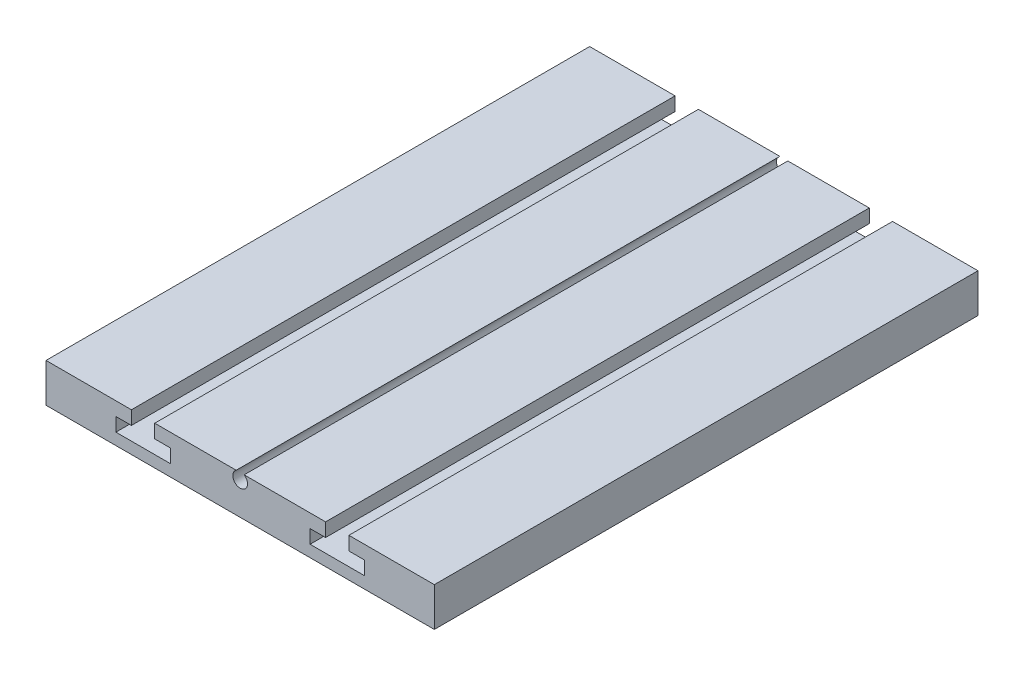
ISO-10303-21;
HEADER;
FILE_DESCRIPTION(('STEP AP214'),'2;1');
FILE_NAME('part.step','',(''),(''),'','','');
FILE_SCHEMA(('AUTOMOTIVE_DESIGN { 1 0 10303 214 1 1 1 1 }'));
ENDSEC;
DATA;
#1=APPLICATION_CONTEXT('core data for automotive mechanical design processes');
#2=APPLICATION_PROTOCOL_DEFINITION('international standard','automotive_design',2000,#1);
#3=PRODUCT_CONTEXT('',#1,'mechanical');
#4=PRODUCT('Part','Part','',(#3));
#5=PRODUCT_RELATED_PRODUCT_CATEGORY('part','',(#4));
#6=PRODUCT_DEFINITION_FORMATION('','',#4);
#7=PRODUCT_DEFINITION_CONTEXT('part definition',#1,'design');
#8=PRODUCT_DEFINITION('design','',#6,#7);
#9=PRODUCT_DEFINITION_SHAPE('','',#8);
#10=(LENGTH_UNIT() NAMED_UNIT(*) SI_UNIT(.MILLI.,.METRE.));
#11=(NAMED_UNIT(*) PLANE_ANGLE_UNIT() SI_UNIT($,.RADIAN.));
#12=(NAMED_UNIT(*) SI_UNIT($,.STERADIAN.) SOLID_ANGLE_UNIT());
#13=UNCERTAINTY_MEASURE_WITH_UNIT(LENGTH_MEASURE(1.E-05),#10,'distance_accuracy_value','');
#14=(GEOMETRIC_REPRESENTATION_CONTEXT(3) GLOBAL_UNCERTAINTY_ASSIGNED_CONTEXT((#13)) GLOBAL_UNIT_ASSIGNED_CONTEXT((#10,
#11,#12)) REPRESENTATION_CONTEXT('',''));
#15=CARTESIAN_POINT('',(0.,0.,0.));
#16=DIRECTION('',(0.,0.,1.));
#17=DIRECTION('',(1.,0.,0.));
#18=AXIS2_PLACEMENT_3D('',#15,#16,#17);
#19=CARTESIAN_POINT('',(0.,5.,70.));
#20=DIRECTION('',(0.,-1.,0.));
#21=DIRECTION('',(0.,0.,-1.));
#22=AXIS2_PLACEMENT_3D('',#19,#20,#21);
#23=PLANE('',#22);
#24=DIRECTION('',(-1.,0.,0.));
#25=VECTOR('',#24,1.);
#26=CARTESIAN_POINT('',(0.,5.,70.));
#27=LINE('',#26,#25);
#28=CARTESIAN_POINT('',(36.,5.,70.));
#29=VERTEX_POINT('',#28);
#30=CARTESIAN_POINT('',(25.512347538298,5.,70.));
#31=VERTEX_POINT('',#30);
#32=EDGE_CURVE('E326',#29,#31,#27,.T.);
#33=ORIENTED_EDGE('',*,*,#32,.F.);
#34=DIRECTION('',(0.,0.,1.));
#35=VECTOR('',#34,1.);
#36=CARTESIAN_POINT('',(36.,5.,0.));
#37=LINE('',#36,#35);
#38=CARTESIAN_POINT('',(36.,5.,0.));
#39=VERTEX_POINT('',#38);
#40=EDGE_CURVE('E301',#39,#29,#37,.T.);
#41=ORIENTED_EDGE('',*,*,#40,.F.);
#42=DIRECTION('',(-1.,0.,0.));
#43=VECTOR('',#42,1.);
#44=CARTESIAN_POINT('',(0.,5.,0.));
#45=LINE('',#44,#43);
#46=CARTESIAN_POINT('',(25.512347538298,5.,0.));
#47=VERTEX_POINT('',#46);
#48=EDGE_CURVE('E336',#39,#47,#45,.T.);
#49=ORIENTED_EDGE('',*,*,#48,.T.);
#50=DIRECTION('',(0.,0.,1.));
#51=VECTOR('',#50,1.);
#52=CARTESIAN_POINT('',(25.512347538298,5.,0.));
#53=LINE('',#52,#51);
#54=EDGE_CURVE('E57',#47,#31,#53,.T.);
#55=ORIENTED_EDGE('',*,*,#54,.T.);
#56=EDGE_LOOP('',(#33,#41,#49,#55));
#57=FACE_BOUND('',#56,.T.);
#58=ADVANCED_FACE('F35',(#57),#23,.F.);
#59=CARTESIAN_POINT('',(11.,5.,70.));
#60=VERTEX_POINT('',#59);
#61=CARTESIAN_POINT('',(0.,5.,70.));
#62=VERTEX_POINT('',#61);
#63=EDGE_CURVE('E321',#60,#62,#27,.T.);
#64=ORIENTED_EDGE('',*,*,#63,.F.);
#65=DIRECTION('',(0.,0.,1.));
#66=VECTOR('',#65,1.);
#67=CARTESIAN_POINT('',(11.,5.,0.));
#68=LINE('',#67,#66);
#69=CARTESIAN_POINT('',(11.,5.,0.));
#70=VERTEX_POINT('',#69);
#71=EDGE_CURVE('E241',#70,#60,#68,.T.);
#72=ORIENTED_EDGE('',*,*,#71,.F.);
#73=CARTESIAN_POINT('',(0.,5.,0.));
#74=VERTEX_POINT('',#73);
#75=EDGE_CURVE('E333',#70,#74,#45,.T.);
#76=ORIENTED_EDGE('',*,*,#75,.T.);
#77=DIRECTION('',(0.,0.,-1.));
#78=VECTOR('',#77,1.);
#79=CARTESIAN_POINT('',(0.,5.,70.));
#80=LINE('',#79,#78);
#81=EDGE_CURVE('E325',#62,#74,#80,.T.);
#82=ORIENTED_EDGE('',*,*,#81,.F.);
#83=EDGE_LOOP('',(#64,#72,#76,#82));
#84=FACE_BOUND('',#83,.T.);
#85=ADVANCED_FACE('F374',(#84),#23,.F.);
#86=CARTESIAN_POINT('',(50.,5.,0.));
#87=VERTEX_POINT('',#86);
#88=CARTESIAN_POINT('',(39.,5.,0.));
#89=VERTEX_POINT('',#88);
#90=EDGE_CURVE('E317',#87,#89,#45,.T.);
#91=ORIENTED_EDGE('',*,*,#90,.T.);
#92=DIRECTION('',(0.,0.,1.));
#93=VECTOR('',#92,1.);
#94=CARTESIAN_POINT('',(39.,5.,0.));
#95=LINE('',#94,#93);
#96=CARTESIAN_POINT('',(39.,5.,70.));
#97=VERTEX_POINT('',#96);
#98=EDGE_CURVE('E303',#89,#97,#95,.T.);
#99=ORIENTED_EDGE('',*,*,#98,.T.);
#100=CARTESIAN_POINT('',(50.,5.,70.));
#101=VERTEX_POINT('',#100);
#102=EDGE_CURVE('E322',#101,#97,#27,.T.);
#103=ORIENTED_EDGE('',*,*,#102,.F.);
#104=DIRECTION('',(0.,0.,-1.));
#105=VECTOR('',#104,1.);
#106=CARTESIAN_POINT('',(50.,5.,70.));
#107=LINE('',#106,#105);
#108=EDGE_CURVE('E339',#101,#87,#107,.T.);
#109=ORIENTED_EDGE('',*,*,#108,.T.);
#110=EDGE_LOOP('',(#91,#99,#103,#109));
#111=FACE_BOUND('',#110,.T.);
#112=ADVANCED_FACE('F362',(#111),#23,.F.);
#113=CARTESIAN_POINT('',(0.,0.,70.));
#114=DIRECTION('',(1.,0.,0.));
#115=DIRECTION('',(0.,0.,-1.));
#116=AXIS2_PLACEMENT_3D('',#113,#114,#115);
#117=PLANE('',#116);
#118=DIRECTION('',(0.,-1.,0.));
#119=VECTOR('',#118,1.);
#120=CARTESIAN_POINT('',(0.,0.,0.));
#121=LINE('',#120,#119);
#122=CARTESIAN_POINT('',(0.,0.,0.));
#123=VERTEX_POINT('',#122);
#124=EDGE_CURVE('E312',#74,#123,#121,.T.);
#125=ORIENTED_EDGE('',*,*,#124,.T.);
#126=DIRECTION('',(0.,0.,-1.));
#127=VECTOR('',#126,1.);
#128=CARTESIAN_POINT('',(0.,0.,70.));
#129=LINE('',#128,#127);
#130=CARTESIAN_POINT('',(0.,0.,70.));
#131=VERTEX_POINT('',#130);
#132=EDGE_CURVE('E43',#131,#123,#129,.T.);
#133=ORIENTED_EDGE('',*,*,#132,.F.);
#134=DIRECTION('',(0.,-1.,0.));
#135=VECTOR('',#134,1.);
#136=CARTESIAN_POINT('',(0.,0.,70.));
#137=LINE('',#136,#135);
#138=EDGE_CURVE('E313',#62,#131,#137,.T.);
#139=ORIENTED_EDGE('',*,*,#138,.F.);
#140=ORIENTED_EDGE('',*,*,#81,.T.);
#141=EDGE_LOOP('',(#125,#133,#139,#140));
#142=FACE_BOUND('',#141,.T.);
#143=ADVANCED_FACE('F37',(#142),#117,.F.);
#144=CARTESIAN_POINT('',(0.,0.,70.));
#145=DIRECTION('',(0.,1.,0.));
#146=DIRECTION('',(0.,0.,1.));
#147=AXIS2_PLACEMENT_3D('',#144,#145,#146);
#148=PLANE('',#147);
#149=DIRECTION('',(1.,0.,0.));
#150=VECTOR('',#149,1.);
#151=CARTESIAN_POINT('',(0.,0.,0.));
#152=LINE('',#151,#150);
#153=CARTESIAN_POINT('',(50.,0.,0.));
#154=VERTEX_POINT('',#153);
#155=EDGE_CURVE('E329',#123,#154,#152,.T.);
#156=ORIENTED_EDGE('',*,*,#155,.T.);
#157=DIRECTION('',(0.,0.,-1.));
#158=VECTOR('',#157,1.);
#159=CARTESIAN_POINT('',(50.,0.,70.));
#160=LINE('',#159,#158);
#161=CARTESIAN_POINT('',(50.,0.,70.));
#162=VERTEX_POINT('',#161);
#163=EDGE_CURVE('E342',#162,#154,#160,.T.);
#164=ORIENTED_EDGE('',*,*,#163,.F.);
#165=DIRECTION('',(1.,0.,0.));
#166=VECTOR('',#165,1.);
#167=CARTESIAN_POINT('',(0.,0.,70.));
#168=LINE('',#167,#166);
#169=EDGE_CURVE('E316',#131,#162,#168,.T.);
#170=ORIENTED_EDGE('',*,*,#169,.F.);
#171=ORIENTED_EDGE('',*,*,#132,.T.);
#172=EDGE_LOOP('',(#156,#164,#170,#171));
#173=FACE_BOUND('',#172,.T.);
#174=ADVANCED_FACE('F347',(#173),#148,.F.);
#175=CARTESIAN_POINT('',(50.,0.,70.));
#176=DIRECTION('',(-1.,0.,0.));
#177=DIRECTION('',(0.,0.,1.));
#178=AXIS2_PLACEMENT_3D('',#175,#176,#177);
#179=PLANE('',#178);
#180=DIRECTION('',(0.,1.,0.));
#181=VECTOR('',#180,1.);
#182=CARTESIAN_POINT('',(50.,0.,0.));
#183=LINE('',#182,#181);
#184=EDGE_CURVE('E331',#154,#87,#183,.T.);
#185=ORIENTED_EDGE('',*,*,#184,.T.);
#186=ORIENTED_EDGE('',*,*,#108,.F.);
#187=DIRECTION('',(0.,1.,0.));
#188=VECTOR('',#187,1.);
#189=CARTESIAN_POINT('',(50.,0.,70.));
#190=LINE('',#189,#188);
#191=EDGE_CURVE('E319',#162,#101,#190,.T.);
#192=ORIENTED_EDGE('',*,*,#191,.F.);
#193=ORIENTED_EDGE('',*,*,#163,.T.);
#194=EDGE_LOOP('',(#185,#186,#192,#193));
#195=FACE_BOUND('',#194,.T.);
#196=ADVANCED_FACE('F358',(#195),#179,.F.);
#197=CARTESIAN_POINT('',(24.487652461702,5.,0.));
#198=VERTEX_POINT('',#197);
#199=CARTESIAN_POINT('',(14.,5.,0.));
#200=VERTEX_POINT('',#199);
#201=EDGE_CURVE('E375',#198,#200,#45,.T.);
#202=ORIENTED_EDGE('',*,*,#201,.T.);
#203=DIRECTION('',(0.,0.,1.));
#204=VECTOR('',#203,1.);
#205=CARTESIAN_POINT('',(14.,5.,0.));
#206=LINE('',#205,#204);
#207=CARTESIAN_POINT('',(14.,5.,70.));
#208=VERTEX_POINT('',#207);
#209=EDGE_CURVE('E243',#200,#208,#206,.T.);
#210=ORIENTED_EDGE('',*,*,#209,.T.);
#211=CARTESIAN_POINT('',(24.487652461702,5.,70.));
#212=VERTEX_POINT('',#211);
#213=EDGE_CURVE('E373',#212,#208,#27,.T.);
#214=ORIENTED_EDGE('',*,*,#213,.F.);
#215=DIRECTION('',(0.,0.,1.));
#216=VECTOR('',#215,1.);
#217=CARTESIAN_POINT('',(24.487652461702,5.,0.));
#218=LINE('',#217,#216);
#219=EDGE_CURVE('E308',#212,#198,#218,.F.);
#220=ORIENTED_EDGE('',*,*,#219,.T.);
#221=EDGE_LOOP('',(#202,#210,#214,#220));
#222=FACE_BOUND('',#221,.T.);
#223=ADVANCED_FACE('F388',(#222),#23,.F.);
#224=CARTESIAN_POINT('',(0.,0.,70.));
#225=DIRECTION('',(0.,0.,-1.));
#226=DIRECTION('',(-1.,0.,0.));
#227=AXIS2_PLACEMENT_3D('',#224,#225,#226);
#228=PLANE('',#227);
#229=DIRECTION('',(-1.,0.,0.));
#230=VECTOR('',#229,1.);
#231=CARTESIAN_POINT('',(36.,3.25,70.));
#232=LINE('',#231,#230);
#233=CARTESIAN_POINT('',(36.,3.25,70.));
#234=VERTEX_POINT('',#233);
#235=CARTESIAN_POINT('',(34.,3.25,70.));
#236=VERTEX_POINT('',#235);
#237=EDGE_CURVE('E281',#234,#236,#232,.T.);
#238=ORIENTED_EDGE('',*,*,#237,.F.);
#239=DIRECTION('',(0.,-1.,0.));
#240=VECTOR('',#239,1.);
#241=CARTESIAN_POINT('',(36.,5.,70.));
#242=LINE('',#241,#240);
#243=EDGE_CURVE('E278',#29,#234,#242,.T.);
#244=ORIENTED_EDGE('',*,*,#243,.F.);
#245=ORIENTED_EDGE('',*,*,#32,.T.);
#246=CARTESIAN_POINT('',(25.,4.2,70.));
#247=DIRECTION('',(0.,0.,1.));
#248=DIRECTION('',(1.,0.,0.));
#249=AXIS2_PLACEMENT_3D('',#246,#247,#248);
#250=CIRCLE('',#249,0.950000000000001);
#251=EDGE_CURVE('E238',#212,#31,#250,.T.);
#252=ORIENTED_EDGE('',*,*,#251,.F.);
#253=ORIENTED_EDGE('',*,*,#213,.T.);
#254=DIRECTION('',(0.,1.,0.));
#255=VECTOR('',#254,1.);
#256=CARTESIAN_POINT('',(14.,5.,70.));
#257=LINE('',#256,#255);
#258=CARTESIAN_POINT('',(14.,3.25,70.));
#259=VERTEX_POINT('',#258);
#260=EDGE_CURVE('E232',#259,#208,#257,.T.);
#261=ORIENTED_EDGE('',*,*,#260,.F.);
#262=DIRECTION('',(-1.,0.,0.));
#263=VECTOR('',#262,1.);
#264=CARTESIAN_POINT('',(14.,3.25,70.));
#265=LINE('',#264,#263);
#266=CARTESIAN_POINT('',(16.,3.25,70.));
#267=VERTEX_POINT('',#266);
#268=EDGE_CURVE('E229',#267,#259,#265,.T.);
#269=ORIENTED_EDGE('',*,*,#268,.F.);
#270=DIRECTION('',(0.,1.,0.));
#271=VECTOR('',#270,1.);
#272=CARTESIAN_POINT('',(16.,3.25,70.));
#273=LINE('',#272,#271);
#274=CARTESIAN_POINT('',(16.,1.5,70.));
#275=VERTEX_POINT('',#274);
#276=EDGE_CURVE('E226',#275,#267,#273,.T.);
#277=ORIENTED_EDGE('',*,*,#276,.F.);
#278=DIRECTION('',(1.,0.,0.));
#279=VECTOR('',#278,1.);
#280=CARTESIAN_POINT('',(9.,1.5,70.));
#281=LINE('',#280,#279);
#282=CARTESIAN_POINT('',(9.,1.5,70.));
#283=VERTEX_POINT('',#282);
#284=EDGE_CURVE('E223',#283,#275,#281,.T.);
#285=ORIENTED_EDGE('',*,*,#284,.F.);
#286=DIRECTION('',(0.,-1.,0.));
#287=VECTOR('',#286,1.);
#288=CARTESIAN_POINT('',(9.,3.25,70.));
#289=LINE('',#288,#287);
#290=CARTESIAN_POINT('',(9.,3.25,70.));
#291=VERTEX_POINT('',#290);
#292=EDGE_CURVE('E190',#291,#283,#289,.T.);
#293=ORIENTED_EDGE('',*,*,#292,.F.);
#294=DIRECTION('',(-1.,0.,0.));
#295=VECTOR('',#294,1.);
#296=CARTESIAN_POINT('',(9.,3.25,70.));
#297=LINE('',#296,#295);
#298=CARTESIAN_POINT('',(11.,3.25,70.));
#299=VERTEX_POINT('',#298);
#300=EDGE_CURVE('E206',#299,#291,#297,.T.);
#301=ORIENTED_EDGE('',*,*,#300,.F.);
#302=DIRECTION('',(0.,-1.,0.));
#303=VECTOR('',#302,1.);
#304=CARTESIAN_POINT('',(11.,5.,70.));
#305=LINE('',#304,#303);
#306=EDGE_CURVE('E209',#60,#299,#305,.T.);
#307=ORIENTED_EDGE('',*,*,#306,.F.);
#308=ORIENTED_EDGE('',*,*,#63,.T.);
#309=ORIENTED_EDGE('',*,*,#138,.T.);
#310=ORIENTED_EDGE('',*,*,#169,.T.);
#311=ORIENTED_EDGE('',*,*,#191,.T.);
#312=ORIENTED_EDGE('',*,*,#102,.T.);
#313=DIRECTION('',(0.,1.,0.));
#314=VECTOR('',#313,1.);
#315=CARTESIAN_POINT('',(39.,5.,70.));
#316=LINE('',#315,#314);
#317=CARTESIAN_POINT('',(39.,3.25,70.));
#318=VERTEX_POINT('',#317);
#319=EDGE_CURVE('E276',#318,#97,#316,.T.);
#320=ORIENTED_EDGE('',*,*,#319,.F.);
#321=DIRECTION('',(-1.,0.,0.));
#322=VECTOR('',#321,1.);
#323=CARTESIAN_POINT('',(41.,3.25,70.));
#324=LINE('',#323,#322);
#325=CARTESIAN_POINT('',(41.,3.25,70.));
#326=VERTEX_POINT('',#325);
#327=EDGE_CURVE('E273',#326,#318,#324,.T.);
#328=ORIENTED_EDGE('',*,*,#327,.F.);
#329=DIRECTION('',(0.,1.,0.));
#330=VECTOR('',#329,1.);
#331=CARTESIAN_POINT('',(41.,3.25,70.));
#332=LINE('',#331,#330);
#333=CARTESIAN_POINT('',(41.,1.5,70.));
#334=VERTEX_POINT('',#333);
#335=EDGE_CURVE('E255',#334,#326,#332,.T.);
#336=ORIENTED_EDGE('',*,*,#335,.F.);
#337=DIRECTION('',(1.,0.,0.));
#338=VECTOR('',#337,1.);
#339=CARTESIAN_POINT('',(41.,1.5,70.));
#340=LINE('',#339,#338);
#341=CARTESIAN_POINT('',(34.,1.5,70.));
#342=VERTEX_POINT('',#341);
#343=EDGE_CURVE('E287',#342,#334,#340,.T.);
#344=ORIENTED_EDGE('',*,*,#343,.F.);
#345=DIRECTION('',(0.,-1.,0.));
#346=VECTOR('',#345,1.);
#347=CARTESIAN_POINT('',(34.,3.25,70.));
#348=LINE('',#347,#346);
#349=EDGE_CURVE('E284',#236,#342,#348,.T.);
#350=ORIENTED_EDGE('',*,*,#349,.F.);
#351=EDGE_LOOP('',(#238,#244,#245,#252,#253,#261,#269,#277,#285,#293,#301,#307,#308,#309,#310,
#311,#312,#320,#328,#336,#344,#350));
#352=FACE_BOUND('',#351,.T.);
#353=ADVANCED_FACE('F366',(#352),#228,.F.);
#354=CARTESIAN_POINT('',(0.,0.,0.));
#355=DIRECTION('',(0.,0.,-1.));
#356=DIRECTION('',(-1.,0.,0.));
#357=AXIS2_PLACEMENT_3D('',#354,#355,#356);
#358=PLANE('',#357);
#359=DIRECTION('',(0.,-1.,0.));
#360=VECTOR('',#359,1.);
#361=CARTESIAN_POINT('',(36.,5.,0.));
#362=LINE('',#361,#360);
#363=CARTESIAN_POINT('',(36.,3.25,0.));
#364=VERTEX_POINT('',#363);
#365=EDGE_CURVE('E258',#39,#364,#362,.T.);
#366=ORIENTED_EDGE('',*,*,#365,.T.);
#367=DIRECTION('',(-1.,0.,0.));
#368=VECTOR('',#367,1.);
#369=CARTESIAN_POINT('',(36.,3.25,0.));
#370=LINE('',#369,#368);
#371=CARTESIAN_POINT('',(34.,3.25,0.));
#372=VERTEX_POINT('',#371);
#373=EDGE_CURVE('E260',#364,#372,#370,.T.);
#374=ORIENTED_EDGE('',*,*,#373,.T.);
#375=DIRECTION('',(0.,-1.,0.));
#376=VECTOR('',#375,1.);
#377=CARTESIAN_POINT('',(34.,3.25,0.));
#378=LINE('',#377,#376);
#379=CARTESIAN_POINT('',(34.,1.5,0.));
#380=VERTEX_POINT('',#379);
#381=EDGE_CURVE('E263',#372,#380,#378,.T.);
#382=ORIENTED_EDGE('',*,*,#381,.T.);
#383=DIRECTION('',(1.,0.,0.));
#384=VECTOR('',#383,1.);
#385=CARTESIAN_POINT('',(41.,1.5,0.));
#386=LINE('',#385,#384);
#387=CARTESIAN_POINT('',(41.,1.5,0.));
#388=VERTEX_POINT('',#387);
#389=EDGE_CURVE('E266',#380,#388,#386,.T.);
#390=ORIENTED_EDGE('',*,*,#389,.T.);
#391=DIRECTION('',(0.,1.,0.));
#392=VECTOR('',#391,1.);
#393=CARTESIAN_POINT('',(41.,3.25,0.));
#394=LINE('',#393,#392);
#395=CARTESIAN_POINT('',(41.,3.25,0.));
#396=VERTEX_POINT('',#395);
#397=EDGE_CURVE('E269',#388,#396,#394,.T.);
#398=ORIENTED_EDGE('',*,*,#397,.T.);
#399=DIRECTION('',(-1.,0.,0.));
#400=VECTOR('',#399,1.);
#401=CARTESIAN_POINT('',(41.,3.25,0.));
#402=LINE('',#401,#400);
#403=CARTESIAN_POINT('',(39.,3.25,0.));
#404=VERTEX_POINT('',#403);
#405=EDGE_CURVE('E251',#396,#404,#402,.T.);
#406=ORIENTED_EDGE('',*,*,#405,.T.);
#407=DIRECTION('',(0.,1.,0.));
#408=VECTOR('',#407,1.);
#409=CARTESIAN_POINT('',(39.,5.,0.));
#410=LINE('',#409,#408);
#411=EDGE_CURVE('E254',#404,#89,#410,.T.);
#412=ORIENTED_EDGE('',*,*,#411,.T.);
#413=ORIENTED_EDGE('',*,*,#90,.F.);
#414=ORIENTED_EDGE('',*,*,#184,.F.);
#415=ORIENTED_EDGE('',*,*,#155,.F.);
#416=ORIENTED_EDGE('',*,*,#124,.F.);
#417=ORIENTED_EDGE('',*,*,#75,.F.);
#418=DIRECTION('',(0.,-1.,0.));
#419=VECTOR('',#418,1.);
#420=CARTESIAN_POINT('',(11.,5.,0.));
#421=LINE('',#420,#419);
#422=CARTESIAN_POINT('',(11.,3.25,0.));
#423=VERTEX_POINT('',#422);
#424=EDGE_CURVE('E219',#70,#423,#421,.T.);
#425=ORIENTED_EDGE('',*,*,#424,.T.);
#426=DIRECTION('',(-1.,0.,0.));
#427=VECTOR('',#426,1.);
#428=CARTESIAN_POINT('',(9.,3.25,0.));
#429=LINE('',#428,#427);
#430=CARTESIAN_POINT('',(9.,3.25,0.));
#431=VERTEX_POINT('',#430);
#432=EDGE_CURVE('E195',#423,#431,#429,.T.);
#433=ORIENTED_EDGE('',*,*,#432,.T.);
#434=DIRECTION('',(0.,-1.,0.));
#435=VECTOR('',#434,1.);
#436=CARTESIAN_POINT('',(9.,3.25,0.));
#437=LINE('',#436,#435);
#438=CARTESIAN_POINT('',(9.,1.5,0.));
#439=VERTEX_POINT('',#438);
#440=EDGE_CURVE('E187',#431,#439,#437,.T.);
#441=ORIENTED_EDGE('',*,*,#440,.T.);
#442=DIRECTION('',(1.,0.,0.));
#443=VECTOR('',#442,1.);
#444=CARTESIAN_POINT('',(9.,1.5,0.));
#445=LINE('',#444,#443);
#446=CARTESIAN_POINT('',(16.,1.5,0.));
#447=VERTEX_POINT('',#446);
#448=EDGE_CURVE('E198',#439,#447,#445,.T.);
#449=ORIENTED_EDGE('',*,*,#448,.T.);
#450=DIRECTION('',(0.,1.,0.));
#451=VECTOR('',#450,1.);
#452=CARTESIAN_POINT('',(16.,3.25,0.));
#453=LINE('',#452,#451);
#454=CARTESIAN_POINT('',(16.,3.25,0.));
#455=VERTEX_POINT('',#454);
#456=EDGE_CURVE('E50',#447,#455,#453,.T.);
#457=ORIENTED_EDGE('',*,*,#456,.T.);
#458=DIRECTION('',(-1.,0.,0.));
#459=VECTOR('',#458,1.);
#460=CARTESIAN_POINT('',(14.,3.25,0.));
#461=LINE('',#460,#459);
#462=CARTESIAN_POINT('',(14.,3.25,0.));
#463=VERTEX_POINT('',#462);
#464=EDGE_CURVE('E213',#455,#463,#461,.T.);
#465=ORIENTED_EDGE('',*,*,#464,.T.);
#466=DIRECTION('',(0.,1.,0.));
#467=VECTOR('',#466,1.);
#468=CARTESIAN_POINT('',(14.,5.,0.));
#469=LINE('',#468,#467);
#470=EDGE_CURVE('E216',#463,#200,#469,.T.);
#471=ORIENTED_EDGE('',*,*,#470,.T.);
#472=ORIENTED_EDGE('',*,*,#201,.F.);
#473=CARTESIAN_POINT('',(25.,4.2,0.));
#474=DIRECTION('',(0.,0.,-1.));
#475=DIRECTION('',(-1.,0.,0.));
#476=AXIS2_PLACEMENT_3D('',#473,#474,#475);
#477=CIRCLE('',#476,0.950000000000001);
#478=EDGE_CURVE('E11',#47,#198,#477,.T.);
#479=ORIENTED_EDGE('',*,*,#478,.F.);
#480=ORIENTED_EDGE('',*,*,#48,.F.);
#481=EDGE_LOOP('',(#366,#374,#382,#390,#398,#406,#412,#413,#414,#415,#416,#417,#425,#433,#441,
#449,#457,#465,#471,#472,#479,#480));
#482=FACE_BOUND('',#481,.T.);
#483=ADVANCED_FACE('F203',(#482),#358,.T.);
#484=CARTESIAN_POINT('',(25.,4.2,0.));
#485=DIRECTION('',(0.,0.,1.));
#486=DIRECTION('',(1.,0.,0.));
#487=AXIS2_PLACEMENT_3D('',#484,#485,#486);
#488=CYLINDRICAL_SURFACE('',#487,0.950000000000001);
#489=ORIENTED_EDGE('',*,*,#478,.T.);
#490=ORIENTED_EDGE('',*,*,#219,.F.);
#491=ORIENTED_EDGE('',*,*,#251,.T.);
#492=ORIENTED_EDGE('',*,*,#54,.F.);
#493=EDGE_LOOP('',(#489,#490,#491,#492));
#494=FACE_BOUND('',#493,.T.);
#495=ADVANCED_FACE('F385',(#494),#488,.F.);
#496=CARTESIAN_POINT('',(9.,3.25,0.));
#497=DIRECTION('',(-1.,0.,0.));
#498=DIRECTION('',(0.,0.,1.));
#499=AXIS2_PLACEMENT_3D('',#496,#497,#498);
#500=PLANE('',#499);
#501=ORIENTED_EDGE('',*,*,#292,.T.);
#502=DIRECTION('',(0.,0.,1.));
#503=VECTOR('',#502,1.);
#504=CARTESIAN_POINT('',(9.,1.5,0.));
#505=LINE('',#504,#503);
#506=EDGE_CURVE('E183',#439,#283,#505,.T.);
#507=ORIENTED_EDGE('',*,*,#506,.F.);
#508=ORIENTED_EDGE('',*,*,#440,.F.);
#509=DIRECTION('',(0.,0.,1.));
#510=VECTOR('',#509,1.);
#511=CARTESIAN_POINT('',(9.,3.25,0.));
#512=LINE('',#511,#510);
#513=EDGE_CURVE('E236',#431,#291,#512,.T.);
#514=ORIENTED_EDGE('',*,*,#513,.T.);
#515=EDGE_LOOP('',(#501,#507,#508,#514));
#516=FACE_BOUND('',#515,.T.);
#517=ADVANCED_FACE('F185',(#516),#500,.F.);
#518=CARTESIAN_POINT('',(9.,3.25,0.));
#519=DIRECTION('',(0.,1.,0.));
#520=DIRECTION('',(0.,0.,1.));
#521=AXIS2_PLACEMENT_3D('',#518,#519,#520);
#522=PLANE('',#521);
#523=ORIENTED_EDGE('',*,*,#300,.T.);
#524=ORIENTED_EDGE('',*,*,#513,.F.);
#525=ORIENTED_EDGE('',*,*,#432,.F.);
#526=DIRECTION('',(0.,0.,1.));
#527=VECTOR('',#526,1.);
#528=CARTESIAN_POINT('',(11.,3.25,0.));
#529=LINE('',#528,#527);
#530=EDGE_CURVE('E239',#423,#299,#529,.T.);
#531=ORIENTED_EDGE('',*,*,#530,.T.);
#532=EDGE_LOOP('',(#523,#524,#525,#531));
#533=FACE_BOUND('',#532,.T.);
#534=ADVANCED_FACE('F496',(#533),#522,.F.);
#535=CARTESIAN_POINT('',(11.,5.,0.));
#536=DIRECTION('',(-1.,0.,0.));
#537=DIRECTION('',(0.,-1.,0.));
#538=AXIS2_PLACEMENT_3D('',#535,#536,#537);
#539=PLANE('',#538);
#540=ORIENTED_EDGE('',*,*,#306,.T.);
#541=ORIENTED_EDGE('',*,*,#530,.F.);
#542=ORIENTED_EDGE('',*,*,#424,.F.);
#543=ORIENTED_EDGE('',*,*,#71,.T.);
#544=EDGE_LOOP('',(#540,#541,#542,#543));
#545=FACE_BOUND('',#544,.T.);
#546=ADVANCED_FACE('F505',(#545),#539,.F.);
#547=CARTESIAN_POINT('',(14.,5.,0.));
#548=DIRECTION('',(1.,0.,0.));
#549=DIRECTION('',(0.,1.,0.));
#550=AXIS2_PLACEMENT_3D('',#547,#548,#549);
#551=PLANE('',#550);
#552=ORIENTED_EDGE('',*,*,#260,.T.);
#553=ORIENTED_EDGE('',*,*,#209,.F.);
#554=ORIENTED_EDGE('',*,*,#470,.F.);
#555=DIRECTION('',(0.,0.,1.));
#556=VECTOR('',#555,1.);
#557=CARTESIAN_POINT('',(14.,3.25,0.));
#558=LINE('',#557,#556);
#559=EDGE_CURVE('E246',#463,#259,#558,.T.);
#560=ORIENTED_EDGE('',*,*,#559,.T.);
#561=EDGE_LOOP('',(#552,#553,#554,#560));
#562=FACE_BOUND('',#561,.T.);
#563=ADVANCED_FACE('F515',(#562),#551,.F.);
#564=CARTESIAN_POINT('',(14.,3.25,0.));
#565=DIRECTION('',(0.,1.,0.));
#566=DIRECTION('',(-1.,0.,0.));
#567=AXIS2_PLACEMENT_3D('',#564,#565,#566);
#568=PLANE('',#567);
#569=ORIENTED_EDGE('',*,*,#268,.T.);
#570=ORIENTED_EDGE('',*,*,#559,.F.);
#571=ORIENTED_EDGE('',*,*,#464,.F.);
#572=DIRECTION('',(0.,0.,1.));
#573=VECTOR('',#572,1.);
#574=CARTESIAN_POINT('',(16.,3.25,0.));
#575=LINE('',#574,#573);
#576=EDGE_CURVE('E248',#455,#267,#575,.T.);
#577=ORIENTED_EDGE('',*,*,#576,.T.);
#578=EDGE_LOOP('',(#569,#570,#571,#577));
#579=FACE_BOUND('',#578,.T.);
#580=ADVANCED_FACE('F525',(#579),#568,.F.);
#581=CARTESIAN_POINT('',(16.,3.25,0.));
#582=DIRECTION('',(1.,0.,0.));
#583=DIRECTION('',(0.,1.,0.));
#584=AXIS2_PLACEMENT_3D('',#581,#582,#583);
#585=PLANE('',#584);
#586=ORIENTED_EDGE('',*,*,#276,.T.);
#587=ORIENTED_EDGE('',*,*,#576,.F.);
#588=ORIENTED_EDGE('',*,*,#456,.F.);
#589=DIRECTION('',(0.,0.,1.));
#590=VECTOR('',#589,1.);
#591=CARTESIAN_POINT('',(16.,1.5,0.));
#592=LINE('',#591,#590);
#593=EDGE_CURVE('E194',#447,#275,#592,.T.);
#594=ORIENTED_EDGE('',*,*,#593,.T.);
#595=EDGE_LOOP('',(#586,#587,#588,#594));
#596=FACE_BOUND('',#595,.T.);
#597=ADVANCED_FACE('F535',(#596),#585,.F.);
#598=CARTESIAN_POINT('',(9.,1.5,0.));
#599=DIRECTION('',(0.,-1.,0.));
#600=DIRECTION('',(1.,0.,0.));
#601=AXIS2_PLACEMENT_3D('',#598,#599,#600);
#602=PLANE('',#601);
#603=ORIENTED_EDGE('',*,*,#284,.T.);
#604=ORIENTED_EDGE('',*,*,#593,.F.);
#605=ORIENTED_EDGE('',*,*,#448,.F.);
#606=ORIENTED_EDGE('',*,*,#506,.T.);
#607=EDGE_LOOP('',(#603,#604,#605,#606));
#608=FACE_BOUND('',#607,.T.);
#609=ADVANCED_FACE('F199',(#608),#602,.F.);
#610=CARTESIAN_POINT('',(41.,3.25,0.));
#611=DIRECTION('',(0.,1.,0.));
#612=DIRECTION('',(-1.,0.,0.));
#613=AXIS2_PLACEMENT_3D('',#610,#611,#612);
#614=PLANE('',#613);
#615=ORIENTED_EDGE('',*,*,#327,.T.);
#616=DIRECTION('',(0.,0.,1.));
#617=VECTOR('',#616,1.);
#618=CARTESIAN_POINT('',(39.,3.25,0.));
#619=LINE('',#618,#617);
#620=EDGE_CURVE('E272',#404,#318,#619,.T.);
#621=ORIENTED_EDGE('',*,*,#620,.F.);
#622=ORIENTED_EDGE('',*,*,#405,.F.);
#623=DIRECTION('',(0.,0.,1.));
#624=VECTOR('',#623,1.);
#625=CARTESIAN_POINT('',(41.,3.25,0.));
#626=LINE('',#625,#624);
#627=EDGE_CURVE('E224',#396,#326,#626,.T.);
#628=ORIENTED_EDGE('',*,*,#627,.T.);
#629=EDGE_LOOP('',(#615,#621,#622,#628));
#630=FACE_BOUND('',#629,.T.);
#631=ADVANCED_FACE('F412',(#630),#614,.F.);
#632=CARTESIAN_POINT('',(41.,3.25,0.));
#633=DIRECTION('',(1.,0.,0.));
#634=DIRECTION('',(0.,0.,-1.));
#635=AXIS2_PLACEMENT_3D('',#632,#633,#634);
#636=PLANE('',#635);
#637=ORIENTED_EDGE('',*,*,#335,.T.);
#638=ORIENTED_EDGE('',*,*,#627,.F.);
#639=ORIENTED_EDGE('',*,*,#397,.F.);
#640=DIRECTION('',(0.,0.,1.));
#641=VECTOR('',#640,1.);
#642=CARTESIAN_POINT('',(41.,1.5,0.));
#643=LINE('',#642,#641);
#644=EDGE_CURVE('E293',#388,#334,#643,.T.);
#645=ORIENTED_EDGE('',*,*,#644,.T.);
#646=EDGE_LOOP('',(#637,#638,#639,#645));
#647=FACE_BOUND('',#646,.T.);
#648=ADVANCED_FACE('F408',(#647),#636,.F.);
#649=CARTESIAN_POINT('',(41.,1.5,0.));
#650=DIRECTION('',(0.,-1.,0.));
#651=DIRECTION('',(1.,0.,0.));
#652=AXIS2_PLACEMENT_3D('',#649,#650,#651);
#653=PLANE('',#652);
#654=ORIENTED_EDGE('',*,*,#343,.T.);
#655=ORIENTED_EDGE('',*,*,#644,.F.);
#656=ORIENTED_EDGE('',*,*,#389,.F.);
#657=DIRECTION('',(0.,0.,1.));
#658=VECTOR('',#657,1.);
#659=CARTESIAN_POINT('',(34.,1.5,0.));
#660=LINE('',#659,#658);
#661=EDGE_CURVE('E295',#380,#342,#660,.T.);
#662=ORIENTED_EDGE('',*,*,#661,.T.);
#663=EDGE_LOOP('',(#654,#655,#656,#662));
#664=FACE_BOUND('',#663,.T.);
#665=ADVANCED_FACE('F404',(#664),#653,.F.);
#666=CARTESIAN_POINT('',(34.,3.25,0.));
#667=DIRECTION('',(-1.,0.,0.));
#668=DIRECTION('',(0.,0.,1.));
#669=AXIS2_PLACEMENT_3D('',#666,#667,#668);
#670=PLANE('',#669);
#671=ORIENTED_EDGE('',*,*,#349,.T.);
#672=ORIENTED_EDGE('',*,*,#661,.F.);
#673=ORIENTED_EDGE('',*,*,#381,.F.);
#674=DIRECTION('',(0.,0.,1.));
#675=VECTOR('',#674,1.);
#676=CARTESIAN_POINT('',(34.,3.25,0.));
#677=LINE('',#676,#675);
#678=EDGE_CURVE('E297',#372,#236,#677,.T.);
#679=ORIENTED_EDGE('',*,*,#678,.T.);
#680=EDGE_LOOP('',(#671,#672,#673,#679));
#681=FACE_BOUND('',#680,.T.);
#682=ADVANCED_FACE('F401',(#681),#670,.F.);
#683=CARTESIAN_POINT('',(36.,3.25,0.));
#684=DIRECTION('',(0.,1.,0.));
#685=DIRECTION('',(0.,0.,1.));
#686=AXIS2_PLACEMENT_3D('',#683,#684,#685);
#687=PLANE('',#686);
#688=ORIENTED_EDGE('',*,*,#237,.T.);
#689=ORIENTED_EDGE('',*,*,#678,.F.);
#690=ORIENTED_EDGE('',*,*,#373,.F.);
#691=DIRECTION('',(0.,0.,1.));
#692=VECTOR('',#691,1.);
#693=CARTESIAN_POINT('',(36.,3.25,0.));
#694=LINE('',#693,#692);
#695=EDGE_CURVE('E299',#364,#234,#694,.T.);
#696=ORIENTED_EDGE('',*,*,#695,.T.);
#697=EDGE_LOOP('',(#688,#689,#690,#696));
#698=FACE_BOUND('',#697,.T.);
#699=ADVANCED_FACE('F397',(#698),#687,.F.);
#700=CARTESIAN_POINT('',(36.,5.,0.));
#701=DIRECTION('',(-1.,0.,0.));
#702=DIRECTION('',(0.,0.,1.));
#703=AXIS2_PLACEMENT_3D('',#700,#701,#702);
#704=PLANE('',#703);
#705=ORIENTED_EDGE('',*,*,#243,.T.);
#706=ORIENTED_EDGE('',*,*,#695,.F.);
#707=ORIENTED_EDGE('',*,*,#365,.F.);
#708=ORIENTED_EDGE('',*,*,#40,.T.);
#709=EDGE_LOOP('',(#705,#706,#707,#708));
#710=FACE_BOUND('',#709,.T.);
#711=ADVANCED_FACE('F394',(#710),#704,.F.);
#712=CARTESIAN_POINT('',(39.,5.,0.));
#713=DIRECTION('',(1.,0.,0.));
#714=DIRECTION('',(0.,1.,0.));
#715=AXIS2_PLACEMENT_3D('',#712,#713,#714);
#716=PLANE('',#715);
#717=ORIENTED_EDGE('',*,*,#319,.T.);
#718=ORIENTED_EDGE('',*,*,#98,.F.);
#719=ORIENTED_EDGE('',*,*,#411,.F.);
#720=ORIENTED_EDGE('',*,*,#620,.T.);
#721=EDGE_LOOP('',(#717,#718,#719,#720));
#722=FACE_BOUND('',#721,.T.);
#723=ADVANCED_FACE('F414',(#722),#716,.F.);
#724=CLOSED_SHELL('',(#58,#85,#112,#143,#174,#196,#223,#353,#483,#495,#517,#534,#546,#563,#580,
#597,#609,#631,#648,#665,#682,#699,#711,#723));
#725=MANIFOLD_SOLID_BREP('B2',#724);
#726=ADVANCED_BREP_SHAPE_REPRESENTATION('',(#18,#725),#14);
#727=SHAPE_DEFINITION_REPRESENTATION(#9,#726);
ENDSEC;
END-ISO-10303-21;
